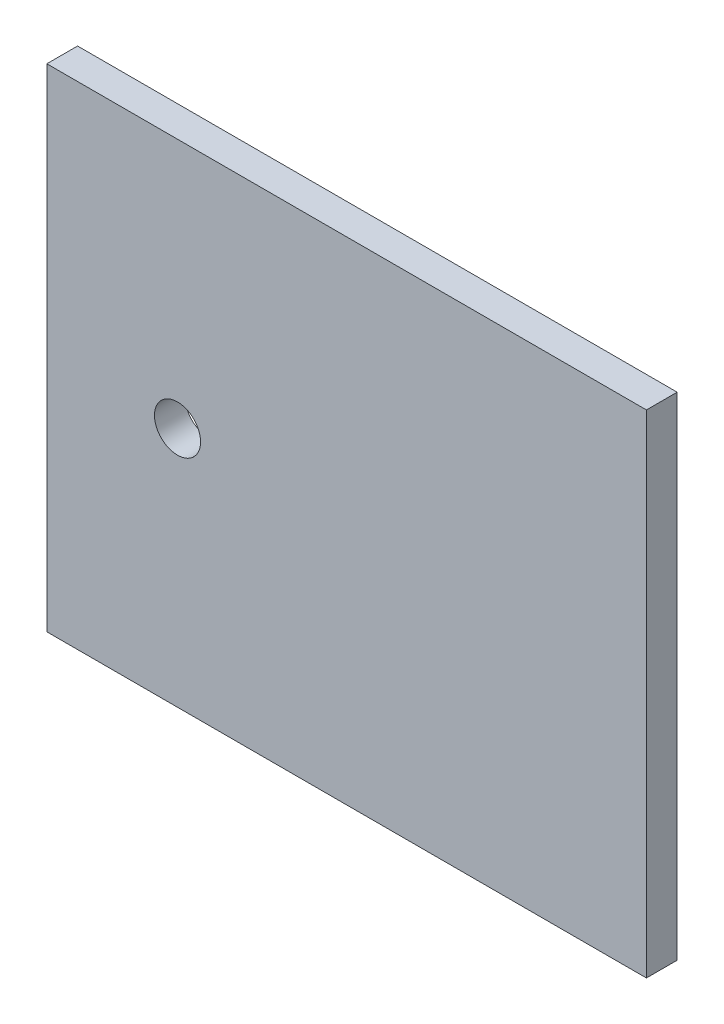
ISO-10303-21;
HEADER;
FILE_DESCRIPTION(('STEP AP214'),'2;1');
FILE_NAME('part.step','',(''),(''),'','','');
FILE_SCHEMA(('AUTOMOTIVE_DESIGN { 1 0 10303 214 1 1 1 1 }'));
ENDSEC;
DATA;
#1=APPLICATION_CONTEXT('core data for automotive mechanical design processes');
#2=APPLICATION_PROTOCOL_DEFINITION('international standard','automotive_design',2000,#1);
#3=PRODUCT_CONTEXT('',#1,'mechanical');
#4=PRODUCT('Part','Part','',(#3));
#5=PRODUCT_RELATED_PRODUCT_CATEGORY('part','',(#4));
#6=PRODUCT_DEFINITION_FORMATION('','',#4);
#7=PRODUCT_DEFINITION_CONTEXT('part definition',#1,'design');
#8=PRODUCT_DEFINITION('design','',#6,#7);
#9=PRODUCT_DEFINITION_SHAPE('','',#8);
#10=(LENGTH_UNIT() NAMED_UNIT(*) SI_UNIT(.MILLI.,.METRE.));
#11=(NAMED_UNIT(*) PLANE_ANGLE_UNIT() SI_UNIT($,.RADIAN.));
#12=(NAMED_UNIT(*) SI_UNIT($,.STERADIAN.) SOLID_ANGLE_UNIT());
#13=UNCERTAINTY_MEASURE_WITH_UNIT(LENGTH_MEASURE(1.E-05),#10,'distance_accuracy_value','');
#14=(GEOMETRIC_REPRESENTATION_CONTEXT(3) GLOBAL_UNCERTAINTY_ASSIGNED_CONTEXT((#13)) GLOBAL_UNIT_ASSIGNED_CONTEXT((#10,
#11,#12)) REPRESENTATION_CONTEXT('',''));
#15=CARTESIAN_POINT('',(0.,0.,0.));
#16=DIRECTION('',(0.,0.,1.));
#17=DIRECTION('',(1.,0.,0.));
#18=AXIS2_PLACEMENT_3D('',#15,#16,#17);
#19=CARTESIAN_POINT('',(0.,0.,2.));
#20=DIRECTION('',(0.,0.,-1.));
#21=DIRECTION('',(-1.,0.,0.));
#22=AXIS2_PLACEMENT_3D('',#19,#20,#21);
#23=PLANE('',#22);
#24=DIRECTION('',(0.,-1.,0.));
#25=VECTOR('',#24,1.);
#26=CARTESIAN_POINT('',(0.,0.,2.));
#27=LINE('',#26,#25);
#28=CARTESIAN_POINT('',(0.,32.,2.));
#29=VERTEX_POINT('',#28);
#30=CARTESIAN_POINT('',(0.,0.,2.));
#31=VERTEX_POINT('',#30);
#32=EDGE_CURVE('E87',#29,#31,#27,.T.);
#33=ORIENTED_EDGE('',*,*,#32,.T.);
#34=DIRECTION('',(1.,0.,0.));
#35=VECTOR('',#34,1.);
#36=CARTESIAN_POINT('',(0.,0.,2.));
#37=LINE('',#36,#35);
#38=CARTESIAN_POINT('',(39.,0.,2.));
#39=VERTEX_POINT('',#38);
#40=EDGE_CURVE('E82',#31,#39,#37,.T.);
#41=ORIENTED_EDGE('',*,*,#40,.T.);
#42=DIRECTION('',(0.,1.,0.));
#43=VECTOR('',#42,1.);
#44=CARTESIAN_POINT('',(39.,0.,2.));
#45=LINE('',#44,#43);
#46=CARTESIAN_POINT('',(39.,32.,2.));
#47=VERTEX_POINT('',#46);
#48=EDGE_CURVE('E85',#39,#47,#45,.T.);
#49=ORIENTED_EDGE('',*,*,#48,.T.);
#50=DIRECTION('',(-1.,0.,0.));
#51=VECTOR('',#50,1.);
#52=CARTESIAN_POINT('',(0.,32.,2.));
#53=LINE('',#52,#51);
#54=EDGE_CURVE('E52',#47,#29,#53,.T.);
#55=ORIENTED_EDGE('',*,*,#54,.T.);
#56=EDGE_LOOP('',(#33,#41,#49,#55));
#57=FACE_BOUND('',#56,.T.);
#58=CARTESIAN_POINT('',(8.5,15.7,2.));
#59=DIRECTION('',(0.,0.,1.));
#60=DIRECTION('',(1.,0.,0.));
#61=AXIS2_PLACEMENT_3D('',#58,#59,#60);
#62=CIRCLE('',#61,1.5);
#63=CARTESIAN_POINT('',(10.,15.7,2.));
#64=VERTEX_POINT('',#63);
#65=EDGE_CURVE('E102',#64,#64,#62,.T.);
#66=ORIENTED_EDGE('',*,*,#65,.F.);
#67=EDGE_LOOP('',(#66));
#68=FACE_BOUND('',#67,.T.);
#69=ADVANCED_FACE('F35',(#57,#68),#23,.F.);
#70=CARTESIAN_POINT('',(0.,0.,0.));
#71=DIRECTION('',(0.,0.,-1.));
#72=DIRECTION('',(-1.,0.,0.));
#73=AXIS2_PLACEMENT_3D('',#70,#71,#72);
#74=PLANE('',#73);
#75=DIRECTION('',(0.,-1.,0.));
#76=VECTOR('',#75,1.);
#77=CARTESIAN_POINT('',(0.,0.,0.));
#78=LINE('',#77,#76);
#79=CARTESIAN_POINT('',(0.,32.,0.));
#80=VERTEX_POINT('',#79);
#81=CARTESIAN_POINT('',(0.,0.,0.));
#82=VERTEX_POINT('',#81);
#83=EDGE_CURVE('E99',#80,#82,#78,.T.);
#84=ORIENTED_EDGE('',*,*,#83,.F.);
#85=DIRECTION('',(-1.,0.,0.));
#86=VECTOR('',#85,1.);
#87=CARTESIAN_POINT('',(0.,32.,0.));
#88=LINE('',#87,#86);
#89=CARTESIAN_POINT('',(39.,32.,0.));
#90=VERTEX_POINT('',#89);
#91=EDGE_CURVE('E75',#90,#80,#88,.T.);
#92=ORIENTED_EDGE('',*,*,#91,.F.);
#93=DIRECTION('',(0.,1.,0.));
#94=VECTOR('',#93,1.);
#95=CARTESIAN_POINT('',(39.,0.,0.));
#96=LINE('',#95,#94);
#97=CARTESIAN_POINT('',(39.,0.,0.));
#98=VERTEX_POINT('',#97);
#99=EDGE_CURVE('E69',#98,#90,#96,.T.);
#100=ORIENTED_EDGE('',*,*,#99,.F.);
#101=DIRECTION('',(1.,0.,0.));
#102=VECTOR('',#101,1.);
#103=CARTESIAN_POINT('',(0.,0.,0.));
#104=LINE('',#103,#102);
#105=EDGE_CURVE('E91',#82,#98,#104,.T.);
#106=ORIENTED_EDGE('',*,*,#105,.F.);
#107=EDGE_LOOP('',(#84,#92,#100,#106));
#108=FACE_BOUND('',#107,.T.);
#109=CARTESIAN_POINT('',(8.5,15.7,0.));
#110=DIRECTION('',(0.,0.,1.));
#111=DIRECTION('',(1.,0.,0.));
#112=AXIS2_PLACEMENT_3D('',#109,#110,#111);
#113=CIRCLE('',#112,1.5);
#114=CARTESIAN_POINT('',(10.,15.7,0.));
#115=VERTEX_POINT('',#114);
#116=EDGE_CURVE('E114',#115,#115,#113,.T.);
#117=ORIENTED_EDGE('',*,*,#116,.T.);
#118=EDGE_LOOP('',(#117));
#119=FACE_BOUND('',#118,.T.);
#120=ADVANCED_FACE('F110',(#108,#119),#74,.T.);
#121=CARTESIAN_POINT('',(0.,0.,2.));
#122=DIRECTION('',(1.,0.,0.));
#123=DIRECTION('',(0.,0.,-1.));
#124=AXIS2_PLACEMENT_3D('',#121,#122,#123);
#125=PLANE('',#124);
#126=ORIENTED_EDGE('',*,*,#83,.T.);
#127=DIRECTION('',(0.,0.,-1.));
#128=VECTOR('',#127,1.);
#129=CARTESIAN_POINT('',(0.,0.,2.));
#130=LINE('',#129,#128);
#131=EDGE_CURVE('E11',#31,#82,#130,.T.);
#132=ORIENTED_EDGE('',*,*,#131,.F.);
#133=ORIENTED_EDGE('',*,*,#32,.F.);
#134=DIRECTION('',(0.,0.,-1.));
#135=VECTOR('',#134,1.);
#136=CARTESIAN_POINT('',(0.,32.,2.));
#137=LINE('',#136,#135);
#138=EDGE_CURVE('E95',#29,#80,#137,.T.);
#139=ORIENTED_EDGE('',*,*,#138,.T.);
#140=EDGE_LOOP('',(#126,#132,#133,#139));
#141=FACE_BOUND('',#140,.T.);
#142=ADVANCED_FACE('F37',(#141),#125,.F.);
#143=CARTESIAN_POINT('',(0.,0.,2.));
#144=DIRECTION('',(0.,1.,0.));
#145=DIRECTION('',(0.,0.,1.));
#146=AXIS2_PLACEMENT_3D('',#143,#144,#145);
#147=PLANE('',#146);
#148=ORIENTED_EDGE('',*,*,#105,.T.);
#149=DIRECTION('',(0.,0.,-1.));
#150=VECTOR('',#149,1.);
#151=CARTESIAN_POINT('',(39.,0.,2.));
#152=LINE('',#151,#150);
#153=EDGE_CURVE('E44',#39,#98,#152,.T.);
#154=ORIENTED_EDGE('',*,*,#153,.F.);
#155=ORIENTED_EDGE('',*,*,#40,.F.);
#156=ORIENTED_EDGE('',*,*,#131,.T.);
#157=EDGE_LOOP('',(#148,#154,#155,#156));
#158=FACE_BOUND('',#157,.T.);
#159=ADVANCED_FACE('F90',(#158),#147,.F.);
#160=CARTESIAN_POINT('',(39.,0.,2.));
#161=DIRECTION('',(-1.,0.,0.));
#162=DIRECTION('',(0.,0.,1.));
#163=AXIS2_PLACEMENT_3D('',#160,#161,#162);
#164=PLANE('',#163);
#165=ORIENTED_EDGE('',*,*,#99,.T.);
#166=DIRECTION('',(0.,0.,-1.));
#167=VECTOR('',#166,1.);
#168=CARTESIAN_POINT('',(39.,32.,2.));
#169=LINE('',#168,#167);
#170=EDGE_CURVE('E92',#47,#90,#169,.T.);
#171=ORIENTED_EDGE('',*,*,#170,.F.);
#172=ORIENTED_EDGE('',*,*,#48,.F.);
#173=ORIENTED_EDGE('',*,*,#153,.T.);
#174=EDGE_LOOP('',(#165,#171,#172,#173));
#175=FACE_BOUND('',#174,.T.);
#176=ADVANCED_FACE('F93',(#175),#164,.F.);
#177=CARTESIAN_POINT('',(0.,32.,2.));
#178=DIRECTION('',(0.,-1.,0.));
#179=DIRECTION('',(0.,0.,-1.));
#180=AXIS2_PLACEMENT_3D('',#177,#178,#179);
#181=PLANE('',#180);
#182=ORIENTED_EDGE('',*,*,#91,.T.);
#183=ORIENTED_EDGE('',*,*,#138,.F.);
#184=ORIENTED_EDGE('',*,*,#54,.F.);
#185=ORIENTED_EDGE('',*,*,#170,.T.);
#186=EDGE_LOOP('',(#182,#183,#184,#185));
#187=FACE_BOUND('',#186,.T.);
#188=ADVANCED_FACE('F107',(#187),#181,.F.);
#189=CARTESIAN_POINT('',(8.5,15.7,2.));
#190=DIRECTION('',(0.,0.,-1.));
#191=DIRECTION('',(-1.,0.,0.));
#192=AXIS2_PLACEMENT_3D('',#189,#190,#191);
#193=CYLINDRICAL_SURFACE('',#192,1.5);
#194=ORIENTED_EDGE('',*,*,#65,.T.);
#195=EDGE_LOOP('',(#194));
#196=FACE_BOUND('',#195,.T.);
#197=ORIENTED_EDGE('',*,*,#116,.F.);
#198=EDGE_LOOP('',(#197));
#199=FACE_BOUND('',#198,.T.);
#200=ADVANCED_FACE('F120',(#196,#199),#193,.F.);
#201=CLOSED_SHELL('',(#69,#120,#142,#159,#176,#188,#200));
#202=MANIFOLD_SOLID_BREP('B2',#201);
#203=ADVANCED_BREP_SHAPE_REPRESENTATION('',(#18,#202),#14);
#204=SHAPE_DEFINITION_REPRESENTATION(#9,#203);
ENDSEC;
END-ISO-10303-21;
